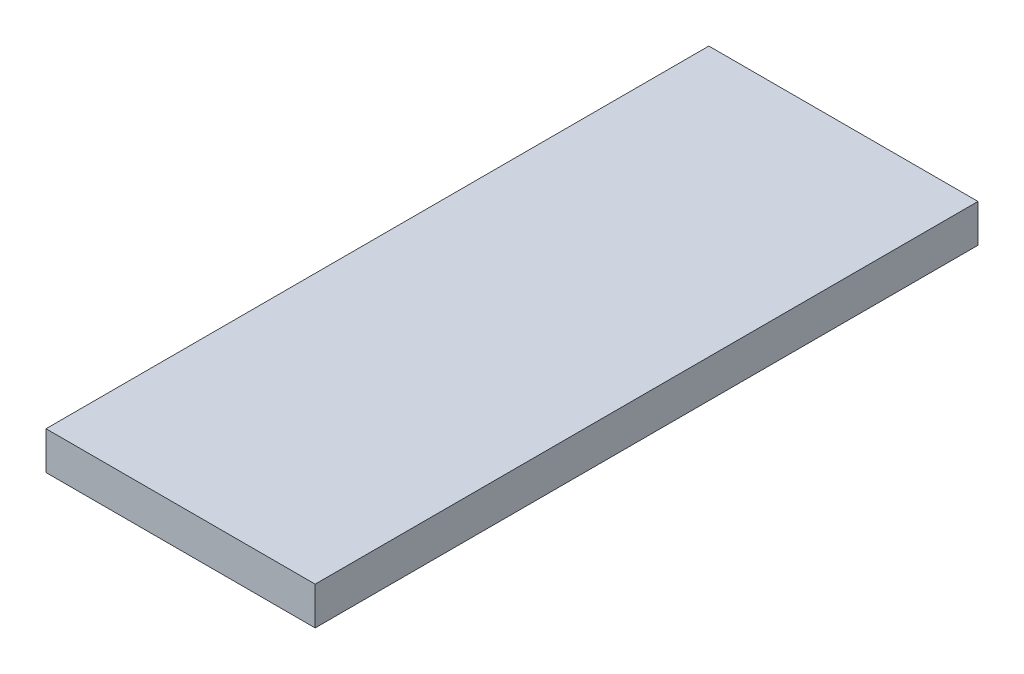
ISO-10303-21;
HEADER;
FILE_DESCRIPTION(('STEP AP214'),'2;1');
FILE_NAME('part.step','',(''),(''),'','','');
FILE_SCHEMA(('AUTOMOTIVE_DESIGN { 1 0 10303 214 1 1 1 1 }'));
ENDSEC;
DATA;
#1=APPLICATION_CONTEXT('core data for automotive mechanical design processes');
#2=APPLICATION_PROTOCOL_DEFINITION('international standard','automotive_design',2000,#1);
#3=PRODUCT_CONTEXT('',#1,'mechanical');
#4=PRODUCT('Part','Part','',(#3));
#5=PRODUCT_RELATED_PRODUCT_CATEGORY('part','',(#4));
#6=PRODUCT_DEFINITION_FORMATION('','',#4);
#7=PRODUCT_DEFINITION_CONTEXT('part definition',#1,'design');
#8=PRODUCT_DEFINITION('design','',#6,#7);
#9=PRODUCT_DEFINITION_SHAPE('','',#8);
#10=(LENGTH_UNIT() NAMED_UNIT(*) SI_UNIT(.MILLI.,.METRE.));
#11=(NAMED_UNIT(*) PLANE_ANGLE_UNIT() SI_UNIT($,.RADIAN.));
#12=(NAMED_UNIT(*) SI_UNIT($,.STERADIAN.) SOLID_ANGLE_UNIT());
#13=UNCERTAINTY_MEASURE_WITH_UNIT(LENGTH_MEASURE(1.E-05),#10,'distance_accuracy_value','');
#14=(GEOMETRIC_REPRESENTATION_CONTEXT(3) GLOBAL_UNCERTAINTY_ASSIGNED_CONTEXT((#13)) GLOBAL_UNIT_ASSIGNED_CONTEXT((#10,
#11,#12)) REPRESENTATION_CONTEXT('',''));
#15=CARTESIAN_POINT('',(0.,0.,0.));
#16=DIRECTION('',(0.,0.,1.));
#17=DIRECTION('',(1.,0.,0.));
#18=AXIS2_PLACEMENT_3D('',#15,#16,#17);
#19=CARTESIAN_POINT('',(0.,2.54,0.));
#20=DIRECTION('',(1.,0.,0.));
#21=DIRECTION('',(0.,0.,-1.));
#22=AXIS2_PLACEMENT_3D('',#19,#20,#21);
#23=PLANE('',#22);
#24=DIRECTION('',(0.,0.,1.));
#25=VECTOR('',#24,1.);
#26=CARTESIAN_POINT('',(0.,0.,0.));
#27=LINE('',#26,#25);
#28=CARTESIAN_POINT('',(0.,0.,-44.3484));
#29=VERTEX_POINT('',#28);
#30=CARTESIAN_POINT('',(0.,0.,0.));
#31=VERTEX_POINT('',#30);
#32=EDGE_CURVE('E96',#29,#31,#27,.T.);
#33=ORIENTED_EDGE('',*,*,#32,.T.);
#34=DIRECTION('',(0.,-1.,0.));
#35=VECTOR('',#34,1.);
#36=CARTESIAN_POINT('',(0.,2.54,0.));
#37=LINE('',#36,#35);
#38=CARTESIAN_POINT('',(0.,2.54,0.));
#39=VERTEX_POINT('',#38);
#40=EDGE_CURVE('E11',#39,#31,#37,.T.);
#41=ORIENTED_EDGE('',*,*,#40,.F.);
#42=DIRECTION('',(0.,0.,1.));
#43=VECTOR('',#42,1.);
#44=CARTESIAN_POINT('',(0.,2.54,0.));
#45=LINE('',#44,#43);
#46=CARTESIAN_POINT('',(0.,2.54,-44.3484));
#47=VERTEX_POINT('',#46);
#48=EDGE_CURVE('E84',#47,#39,#45,.T.);
#49=ORIENTED_EDGE('',*,*,#48,.F.);
#50=DIRECTION('',(0.,-1.,0.));
#51=VECTOR('',#50,1.);
#52=CARTESIAN_POINT('',(0.,2.54,-44.3484));
#53=LINE('',#52,#51);
#54=EDGE_CURVE('E92',#47,#29,#53,.T.);
#55=ORIENTED_EDGE('',*,*,#54,.T.);
#56=EDGE_LOOP('',(#33,#41,#49,#55));
#57=FACE_BOUND('',#56,.T.);
#58=ADVANCED_FACE('F33',(#57),#23,.F.);
#59=CARTESIAN_POINT('',(0.,2.54,0.));
#60=DIRECTION('',(0.,0.,-1.));
#61=DIRECTION('',(-1.,0.,0.));
#62=AXIS2_PLACEMENT_3D('',#59,#60,#61);
#63=PLANE('',#62);
#64=DIRECTION('',(1.,0.,0.));
#65=VECTOR('',#64,1.);
#66=CARTESIAN_POINT('',(0.,0.,0.));
#67=LINE('',#66,#65);
#68=CARTESIAN_POINT('',(18.0086,0.,0.));
#69=VERTEX_POINT('',#68);
#70=EDGE_CURVE('E88',#31,#69,#67,.T.);
#71=ORIENTED_EDGE('',*,*,#70,.T.);
#72=DIRECTION('',(0.,-1.,0.));
#73=VECTOR('',#72,1.);
#74=CARTESIAN_POINT('',(18.0086,2.54,0.));
#75=LINE('',#74,#73);
#76=CARTESIAN_POINT('',(18.0086,2.54,0.));
#77=VERTEX_POINT('',#76);
#78=EDGE_CURVE('E41',#77,#69,#75,.T.);
#79=ORIENTED_EDGE('',*,*,#78,.F.);
#80=DIRECTION('',(1.,0.,0.));
#81=VECTOR('',#80,1.);
#82=CARTESIAN_POINT('',(0.,2.54,0.));
#83=LINE('',#82,#81);
#84=EDGE_CURVE('E79',#39,#77,#83,.T.);
#85=ORIENTED_EDGE('',*,*,#84,.F.);
#86=ORIENTED_EDGE('',*,*,#40,.T.);
#87=EDGE_LOOP('',(#71,#79,#85,#86));
#88=FACE_BOUND('',#87,.T.);
#89=ADVANCED_FACE('F87',(#88),#63,.F.);
#90=CARTESIAN_POINT('',(18.0086,2.54,0.));
#91=DIRECTION('',(-1.,0.,0.));
#92=DIRECTION('',(0.,0.,1.));
#93=AXIS2_PLACEMENT_3D('',#90,#91,#92);
#94=PLANE('',#93);
#95=DIRECTION('',(0.,0.,-1.));
#96=VECTOR('',#95,1.);
#97=CARTESIAN_POINT('',(18.0086,0.,0.));
#98=LINE('',#97,#96);
#99=CARTESIAN_POINT('',(18.0086,0.,-44.3484));
#100=VERTEX_POINT('',#99);
#101=EDGE_CURVE('E66',#69,#100,#98,.T.);
#102=ORIENTED_EDGE('',*,*,#101,.T.);
#103=DIRECTION('',(0.,-1.,0.));
#104=VECTOR('',#103,1.);
#105=CARTESIAN_POINT('',(18.0086,2.54,-44.3484));
#106=LINE('',#105,#104);
#107=CARTESIAN_POINT('',(18.0086,2.54,-44.3484));
#108=VERTEX_POINT('',#107);
#109=EDGE_CURVE('E89',#108,#100,#106,.T.);
#110=ORIENTED_EDGE('',*,*,#109,.F.);
#111=DIRECTION('',(0.,0.,-1.));
#112=VECTOR('',#111,1.);
#113=CARTESIAN_POINT('',(18.0086,2.54,0.));
#114=LINE('',#113,#112);
#115=EDGE_CURVE('E82',#77,#108,#114,.T.);
#116=ORIENTED_EDGE('',*,*,#115,.F.);
#117=ORIENTED_EDGE('',*,*,#78,.T.);
#118=EDGE_LOOP('',(#102,#110,#116,#117));
#119=FACE_BOUND('',#118,.T.);
#120=ADVANCED_FACE('F90',(#119),#94,.F.);
#121=CARTESIAN_POINT('',(0.,2.54,-44.3484));
#122=DIRECTION('',(0.,0.,1.));
#123=DIRECTION('',(1.,0.,0.));
#124=AXIS2_PLACEMENT_3D('',#121,#122,#123);
#125=PLANE('',#124);
#126=DIRECTION('',(-1.,0.,0.));
#127=VECTOR('',#126,1.);
#128=CARTESIAN_POINT('',(0.,0.,-44.3484));
#129=LINE('',#128,#127);
#130=EDGE_CURVE('E72',#100,#29,#129,.T.);
#131=ORIENTED_EDGE('',*,*,#130,.T.);
#132=ORIENTED_EDGE('',*,*,#54,.F.);
#133=DIRECTION('',(-1.,0.,0.));
#134=VECTOR('',#133,1.);
#135=CARTESIAN_POINT('',(0.,2.54,-44.3484));
#136=LINE('',#135,#134);
#137=EDGE_CURVE('E49',#108,#47,#136,.T.);
#138=ORIENTED_EDGE('',*,*,#137,.F.);
#139=ORIENTED_EDGE('',*,*,#109,.T.);
#140=EDGE_LOOP('',(#131,#132,#138,#139));
#141=FACE_BOUND('',#140,.T.);
#142=ADVANCED_FACE('F103',(#141),#125,.F.);
#143=CARTESIAN_POINT('',(0.,2.54,0.));
#144=DIRECTION('',(0.,-1.,0.));
#145=DIRECTION('',(0.,0.,-1.));
#146=AXIS2_PLACEMENT_3D('',#143,#144,#145);
#147=PLANE('',#146);
#148=ORIENTED_EDGE('',*,*,#48,.T.);
#149=ORIENTED_EDGE('',*,*,#84,.T.);
#150=ORIENTED_EDGE('',*,*,#115,.T.);
#151=ORIENTED_EDGE('',*,*,#137,.T.);
#152=EDGE_LOOP('',(#148,#149,#150,#151));
#153=FACE_BOUND('',#152,.T.);
#154=ADVANCED_FACE('F80',(#153),#147,.F.);
#155=CARTESIAN_POINT('',(0.,0.,0.));
#156=DIRECTION('',(0.,-1.,0.));
#157=DIRECTION('',(0.,0.,-1.));
#158=AXIS2_PLACEMENT_3D('',#155,#156,#157);
#159=PLANE('',#158);
#160=ORIENTED_EDGE('',*,*,#32,.F.);
#161=ORIENTED_EDGE('',*,*,#130,.F.);
#162=ORIENTED_EDGE('',*,*,#101,.F.);
#163=ORIENTED_EDGE('',*,*,#70,.F.);
#164=EDGE_LOOP('',(#160,#161,#162,#163));
#165=FACE_BOUND('',#164,.T.);
#166=ADVANCED_FACE('F106',(#165),#159,.T.);
#167=CLOSED_SHELL('',(#58,#89,#120,#142,#154,#166));
#168=MANIFOLD_SOLID_BREP('B2',#167);
#169=ADVANCED_BREP_SHAPE_REPRESENTATION('',(#18,#168),#14);
#170=SHAPE_DEFINITION_REPRESENTATION(#9,#169);
ENDSEC;
END-ISO-10303-21;
